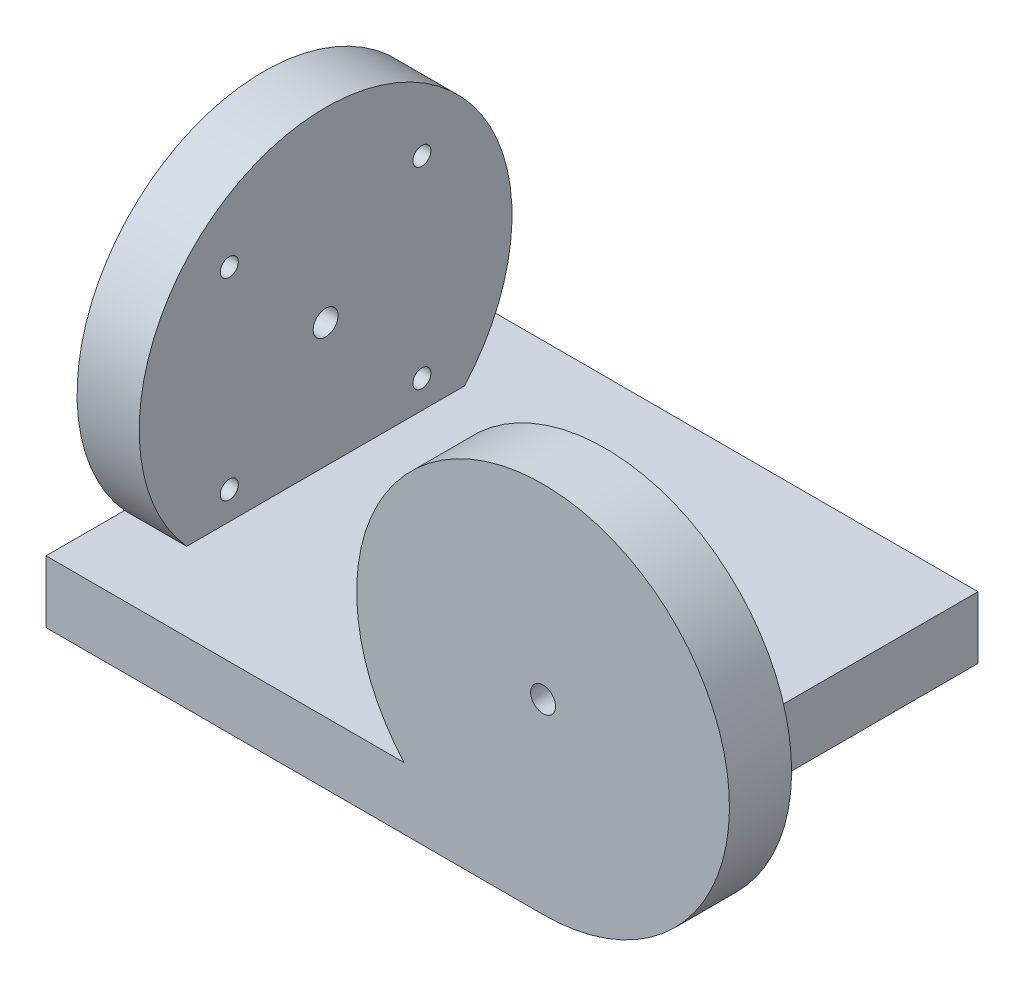
ISO-10303-21;
HEADER;
FILE_DESCRIPTION(('STEP AP214'),'2;1');
FILE_NAME('part.step','',(''),(''),'','','');
FILE_SCHEMA(('AUTOMOTIVE_DESIGN { 1 0 10303 214 1 1 1 1 }'));
ENDSEC;
DATA;
#1=APPLICATION_CONTEXT('core data for automotive mechanical design processes');
#2=APPLICATION_PROTOCOL_DEFINITION('international standard','automotive_design',2000,#1);
#3=PRODUCT_CONTEXT('',#1,'mechanical');
#4=PRODUCT('Part','Part','',(#3));
#5=PRODUCT_RELATED_PRODUCT_CATEGORY('part','',(#4));
#6=PRODUCT_DEFINITION_FORMATION('','',#4);
#7=PRODUCT_DEFINITION_CONTEXT('part definition',#1,'design');
#8=PRODUCT_DEFINITION('design','',#6,#7);
#9=PRODUCT_DEFINITION_SHAPE('','',#8);
#10=(LENGTH_UNIT() NAMED_UNIT(*) SI_UNIT(.MILLI.,.METRE.));
#11=(NAMED_UNIT(*) PLANE_ANGLE_UNIT() SI_UNIT($,.RADIAN.));
#12=(NAMED_UNIT(*) SI_UNIT($,.STERADIAN.) SOLID_ANGLE_UNIT());
#13=UNCERTAINTY_MEASURE_WITH_UNIT(LENGTH_MEASURE(1.E-05),#10,'distance_accuracy_value','');
#14=(GEOMETRIC_REPRESENTATION_CONTEXT(3) GLOBAL_UNCERTAINTY_ASSIGNED_CONTEXT((#13)) GLOBAL_UNIT_ASSIGNED_CONTEXT((#10,
#11,#12)) REPRESENTATION_CONTEXT('',''));
#15=CARTESIAN_POINT('',(0.,0.,0.));
#16=DIRECTION('',(0.,0.,1.));
#17=DIRECTION('',(1.,0.,0.));
#18=AXIS2_PLACEMENT_3D('',#15,#16,#17);
#19=CARTESIAN_POINT('',(0.,0.,0.));
#20=DIRECTION('',(0.,0.,1.));
#21=DIRECTION('',(1.,0.,0.));
#22=AXIS2_PLACEMENT_3D('',#19,#20,#21);
#23=PLANE('',#22);
#24=CARTESIAN_POINT('',(15.5,15.5,0.));
#25=DIRECTION('',(0.,0.,-1.));
#26=DIRECTION('',(-1.,0.,0.));
#27=AXIS2_PLACEMENT_3D('',#24,#25,#26);
#28=CIRCLE('',#27,1.45);
#29=CARTESIAN_POINT('',(14.05,15.5,0.));
#30=VERTEX_POINT('',#29);
#31=EDGE_CURVE('E166',#30,#30,#28,.T.);
#32=ORIENTED_EDGE('',*,*,#31,.F.);
#33=EDGE_LOOP('',(#32));
#34=FACE_BOUND('',#33,.T.);
#35=CARTESIAN_POINT('',(-15.5,15.5,0.));
#36=DIRECTION('',(0.,0.,-1.));
#37=DIRECTION('',(-1.,0.,0.));
#38=AXIS2_PLACEMENT_3D('',#35,#36,#37);
#39=CIRCLE('',#38,1.45);
#40=CARTESIAN_POINT('',(-16.95,15.5,0.));
#41=VERTEX_POINT('',#40);
#42=EDGE_CURVE('E172',#41,#41,#39,.T.);
#43=ORIENTED_EDGE('',*,*,#42,.F.);
#44=EDGE_LOOP('',(#43));
#45=FACE_BOUND('',#44,.T.);
#46=CARTESIAN_POINT('',(-15.5,-15.5,0.));
#47=DIRECTION('',(0.,0.,-1.));
#48=DIRECTION('',(-1.,0.,0.));
#49=AXIS2_PLACEMENT_3D('',#46,#47,#48);
#50=CIRCLE('',#49,1.45);
#51=CARTESIAN_POINT('',(-16.95,-15.5,0.));
#52=VERTEX_POINT('',#51);
#53=EDGE_CURVE('E178',#52,#52,#50,.T.);
#54=ORIENTED_EDGE('',*,*,#53,.F.);
#55=EDGE_LOOP('',(#54));
#56=FACE_BOUND('',#55,.T.);
#57=CARTESIAN_POINT('',(15.5,-15.5,0.));
#58=DIRECTION('',(0.,0.,-1.));
#59=DIRECTION('',(-1.,0.,0.));
#60=AXIS2_PLACEMENT_3D('',#57,#58,#59);
#61=CIRCLE('',#60,1.45);
#62=CARTESIAN_POINT('',(14.05,-15.5,0.));
#63=VERTEX_POINT('',#62);
#64=EDGE_CURVE('E184',#63,#63,#61,.T.);
#65=ORIENTED_EDGE('',*,*,#64,.F.);
#66=EDGE_LOOP('',(#65));
#67=FACE_BOUND('',#66,.T.);
#68=CARTESIAN_POINT('',(0.,0.,0.));
#69=DIRECTION('',(0.,0.,1.));
#70=DIRECTION('',(1.,0.,0.));
#71=AXIS2_PLACEMENT_3D('',#68,#69,#70);
#72=CIRCLE('',#71,30.);
#73=CARTESIAN_POINT('',(0.,-30.,0.));
#74=VERTEX_POINT('',#73);
#75=CARTESIAN_POINT('',(-22.3606797749979,-20.,0.));
#76=VERTEX_POINT('',#75);
#77=EDGE_CURVE('E242',#74,#76,#72,.T.);
#78=ORIENTED_EDGE('',*,*,#77,.F.);
#79=DIRECTION('',(0.,1.,0.));
#80=VECTOR('',#79,1.);
#81=CARTESIAN_POINT('',(0.,0.,0.));
#82=LINE('',#81,#80);
#83=CARTESIAN_POINT('',(0.,-20.,0.));
#84=VERTEX_POINT('',#83);
#85=EDGE_CURVE('E11',#74,#84,#82,.T.);
#86=ORIENTED_EDGE('',*,*,#85,.T.);
#87=DIRECTION('',(-1.,0.,0.));
#88=VECTOR('',#87,1.);
#89=CARTESIAN_POINT('',(0.,-20.,0.));
#90=LINE('',#89,#88);
#91=EDGE_CURVE('E52',#84,#76,#90,.T.);
#92=ORIENTED_EDGE('',*,*,#91,.T.);
#93=EDGE_LOOP('',(#78,#86,#92));
#94=FACE_BOUND('',#93,.T.);
#95=CARTESIAN_POINT('',(0.,0.,0.));
#96=DIRECTION('',(0.,0.,-1.));
#97=DIRECTION('',(-1.,0.,0.));
#98=AXIS2_PLACEMENT_3D('',#95,#96,#97);
#99=CIRCLE('',#98,2.);
#100=CARTESIAN_POINT('',(-2.,0.,0.));
#101=VERTEX_POINT('',#100);
#102=EDGE_CURVE('E190',#101,#101,#99,.T.);
#103=ORIENTED_EDGE('',*,*,#102,.F.);
#104=EDGE_LOOP('',(#103));
#105=FACE_BOUND('',#104,.T.);
#106=ADVANCED_FACE('F44',(#34,#45,#56,#67,#94,#105),#23,.F.);
#107=CARTESIAN_POINT('',(0.,0.,10.));
#108=DIRECTION('',(0.,0.,-1.));
#109=DIRECTION('',(-1.,0.,0.));
#110=AXIS2_PLACEMENT_3D('',#107,#108,#109);
#111=CYLINDRICAL_SURFACE('',#110,30.);
#112=CARTESIAN_POINT('',(0.,0.,10.));
#113=DIRECTION('',(0.,0.,1.));
#114=DIRECTION('',(1.,0.,0.));
#115=AXIS2_PLACEMENT_3D('',#112,#113,#114);
#116=CIRCLE('',#115,30.);
#117=CARTESIAN_POINT('',(0.,-30.,10.));
#118=VERTEX_POINT('',#117);
#119=CARTESIAN_POINT('',(-22.3606797749979,-20.,10.));
#120=VERTEX_POINT('',#119);
#121=EDGE_CURVE('E243',#118,#120,#116,.T.);
#122=ORIENTED_EDGE('',*,*,#121,.F.);
#123=DIRECTION('',(0.,0.,1.));
#124=VECTOR('',#123,1.);
#125=CARTESIAN_POINT('',(0.,-30.,-60.));
#126=LINE('',#125,#124);
#127=EDGE_CURVE('E232',#74,#118,#126,.T.);
#128=ORIENTED_EDGE('',*,*,#127,.F.);
#129=ORIENTED_EDGE('',*,*,#77,.T.);
#130=DIRECTION('',(0.,0.,-1.));
#131=VECTOR('',#130,1.);
#132=CARTESIAN_POINT('',(-22.3606797749979,-20.,10.));
#133=LINE('',#132,#131);
#134=EDGE_CURVE('E231',#76,#120,#133,.F.);
#135=ORIENTED_EDGE('',*,*,#134,.T.);
#136=EDGE_LOOP('',(#122,#128,#129,#135));
#137=FACE_BOUND('',#136,.T.);
#138=ADVANCED_FACE('F46',(#137),#111,.T.);
#139=CARTESIAN_POINT('',(0.,0.,10.));
#140=DIRECTION('',(0.,0.,1.));
#141=DIRECTION('',(1.,0.,0.));
#142=AXIS2_PLACEMENT_3D('',#139,#140,#141);
#143=PLANE('',#142);
#144=CARTESIAN_POINT('',(0.,0.,10.));
#145=DIRECTION('',(0.,0.,1.));
#146=DIRECTION('',(1.,0.,0.));
#147=AXIS2_PLACEMENT_3D('',#144,#145,#146);
#148=CIRCLE('',#147,2.);
#149=CARTESIAN_POINT('',(2.,0.,10.));
#150=VERTEX_POINT('',#149);
#151=EDGE_CURVE('E193',#150,#150,#148,.T.);
#152=ORIENTED_EDGE('',*,*,#151,.F.);
#153=EDGE_LOOP('',(#152));
#154=FACE_BOUND('',#153,.T.);
#155=ORIENTED_EDGE('',*,*,#121,.T.);
#156=DIRECTION('',(-1.,0.,0.));
#157=VECTOR('',#156,1.);
#158=CARTESIAN_POINT('',(0.,-20.,10.));
#159=LINE('',#158,#157);
#160=CARTESIAN_POINT('',(-80.,-20.,10.));
#161=VERTEX_POINT('',#160);
#162=EDGE_CURVE('E206',#120,#161,#159,.T.);
#163=ORIENTED_EDGE('',*,*,#162,.T.);
#164=DIRECTION('',(0.,-1.,0.));
#165=VECTOR('',#164,1.);
#166=CARTESIAN_POINT('',(-80.,-30.,10.));
#167=LINE('',#166,#165);
#168=CARTESIAN_POINT('',(-80.,-30.,10.));
#169=VERTEX_POINT('',#168);
#170=EDGE_CURVE('E223',#161,#169,#167,.T.);
#171=ORIENTED_EDGE('',*,*,#170,.T.);
#172=DIRECTION('',(1.,0.,0.));
#173=VECTOR('',#172,1.);
#174=CARTESIAN_POINT('',(0.,-30.,10.));
#175=LINE('',#174,#173);
#176=EDGE_CURVE('E211',#169,#118,#175,.T.);
#177=ORIENTED_EDGE('',*,*,#176,.T.);
#178=EDGE_LOOP('',(#155,#163,#171,#177));
#179=FACE_BOUND('',#178,.T.);
#180=ADVANCED_FACE('F258',(#154,#179),#143,.T.);
#181=CARTESIAN_POINT('',(0.,-30.,-60.));
#182=DIRECTION('',(1.,0.,0.));
#183=DIRECTION('',(0.,0.,-1.));
#184=AXIS2_PLACEMENT_3D('',#181,#182,#183);
#185=PLANE('',#184);
#186=ORIENTED_EDGE('',*,*,#85,.F.);
#187=CARTESIAN_POINT('',(0.,-30.,-60.));
#188=VERTEX_POINT('',#187);
#189=EDGE_CURVE('E228',#188,#74,#126,.T.);
#190=ORIENTED_EDGE('',*,*,#189,.F.);
#191=DIRECTION('',(0.,1.,0.));
#192=VECTOR('',#191,1.);
#193=CARTESIAN_POINT('',(0.,-30.,-60.));
#194=LINE('',#193,#192);
#195=CARTESIAN_POINT('',(0.,-20.,-60.));
#196=VERTEX_POINT('',#195);
#197=EDGE_CURVE('E207',#188,#196,#194,.T.);
#198=ORIENTED_EDGE('',*,*,#197,.T.);
#199=DIRECTION('',(0.,0.,1.));
#200=VECTOR('',#199,1.);
#201=CARTESIAN_POINT('',(0.,-20.,-60.));
#202=LINE('',#201,#200);
#203=EDGE_CURVE('E220',#196,#84,#202,.T.);
#204=ORIENTED_EDGE('',*,*,#203,.T.);
#205=EDGE_LOOP('',(#186,#190,#198,#204));
#206=FACE_BOUND('',#205,.T.);
#207=ADVANCED_FACE('F269',(#206),#185,.T.);
#208=CARTESIAN_POINT('',(0.,-20.,-60.));
#209=DIRECTION('',(0.,1.,0.));
#210=DIRECTION('',(-1.,0.,0.));
#211=AXIS2_PLACEMENT_3D('',#208,#209,#210);
#212=PLANE('',#211);
#213=DIRECTION('',(-1.,0.,0.));
#214=VECTOR('',#213,1.);
#215=CARTESIAN_POINT('',(-70.,-20.,-47.3606797749979));
#216=LINE('',#215,#214);
#217=CARTESIAN_POINT('',(-70.,-20.,-47.3606797749979));
#218=VERTEX_POINT('',#217);
#219=CARTESIAN_POINT('',(-80.,-20.,-47.3606797749979));
#220=VERTEX_POINT('',#219);
#221=EDGE_CURVE('E64',#218,#220,#216,.T.);
#222=ORIENTED_EDGE('',*,*,#221,.F.);
#223=DIRECTION('',(0.,0.,1.));
#224=VECTOR('',#223,1.);
#225=CARTESIAN_POINT('',(-70.,-20.,-60.));
#226=LINE('',#225,#224);
#227=CARTESIAN_POINT('',(-70.,-20.,-2.6393202250021));
#228=VERTEX_POINT('',#227);
#229=EDGE_CURVE('E59',#218,#228,#226,.T.);
#230=ORIENTED_EDGE('',*,*,#229,.T.);
#231=DIRECTION('',(-1.,0.,0.));
#232=VECTOR('',#231,1.);
#233=CARTESIAN_POINT('',(-70.,-20.,-2.6393202250021));
#234=LINE('',#233,#232);
#235=CARTESIAN_POINT('',(-80.,-20.,-2.6393202250021));
#236=VERTEX_POINT('',#235);
#237=EDGE_CURVE('E200',#236,#228,#234,.F.);
#238=ORIENTED_EDGE('',*,*,#237,.F.);
#239=DIRECTION('',(0.,0.,1.));
#240=VECTOR('',#239,1.);
#241=CARTESIAN_POINT('',(-80.,-20.,-60.));
#242=LINE('',#241,#240);
#243=EDGE_CURVE('E237',#236,#161,#242,.T.);
#244=ORIENTED_EDGE('',*,*,#243,.T.);
#245=ORIENTED_EDGE('',*,*,#162,.F.);
#246=ORIENTED_EDGE('',*,*,#134,.F.);
#247=ORIENTED_EDGE('',*,*,#91,.F.);
#248=ORIENTED_EDGE('',*,*,#203,.F.);
#249=DIRECTION('',(-1.,0.,0.));
#250=VECTOR('',#249,1.);
#251=CARTESIAN_POINT('',(0.,-20.,-60.));
#252=LINE('',#251,#250);
#253=CARTESIAN_POINT('',(-80.,-20.,-60.));
#254=VERTEX_POINT('',#253);
#255=EDGE_CURVE('E210',#196,#254,#252,.T.);
#256=ORIENTED_EDGE('',*,*,#255,.T.);
#257=EDGE_CURVE('E235',#254,#220,#242,.T.);
#258=ORIENTED_EDGE('',*,*,#257,.T.);
#259=EDGE_LOOP('',(#222,#230,#238,#244,#245,#246,#247,#248,#256,#258));
#260=FACE_BOUND('',#259,.T.);
#261=ADVANCED_FACE('F270',(#260),#212,.T.);
#262=CARTESIAN_POINT('',(0.,-30.,-60.));
#263=DIRECTION('',(0.,-1.,0.));
#264=DIRECTION('',(1.,0.,0.));
#265=AXIS2_PLACEMENT_3D('',#262,#263,#264);
#266=PLANE('',#265);
#267=ORIENTED_EDGE('',*,*,#176,.F.);
#268=DIRECTION('',(0.,0.,1.));
#269=VECTOR('',#268,1.);
#270=CARTESIAN_POINT('',(-80.,-30.,-60.));
#271=LINE('',#270,#269);
#272=CARTESIAN_POINT('',(-80.,-30.,-60.));
#273=VERTEX_POINT('',#272);
#274=EDGE_CURVE('E233',#273,#169,#271,.T.);
#275=ORIENTED_EDGE('',*,*,#274,.F.);
#276=DIRECTION('',(1.,0.,0.));
#277=VECTOR('',#276,1.);
#278=CARTESIAN_POINT('',(0.,-30.,-60.));
#279=LINE('',#278,#277);
#280=EDGE_CURVE('E217',#273,#188,#279,.T.);
#281=ORIENTED_EDGE('',*,*,#280,.T.);
#282=ORIENTED_EDGE('',*,*,#189,.T.);
#283=ORIENTED_EDGE('',*,*,#127,.T.);
#284=EDGE_LOOP('',(#267,#275,#281,#282,#283));
#285=FACE_BOUND('',#284,.T.);
#286=ADVANCED_FACE('F256',(#285),#266,.T.);
#287=CARTESIAN_POINT('',(-80.,-30.,-60.));
#288=DIRECTION('',(-1.,0.,0.));
#289=DIRECTION('',(0.,0.,1.));
#290=AXIS2_PLACEMENT_3D('',#287,#288,#289);
#291=PLANE('',#290);
#292=CARTESIAN_POINT('',(-80.,0.,-25.));
#293=DIRECTION('',(-1.,0.,0.));
#294=DIRECTION('',(0.,0.,1.));
#295=AXIS2_PLACEMENT_3D('',#292,#293,#294);
#296=CIRCLE('',#295,2.);
#297=CARTESIAN_POINT('',(-80.,0.,-23.));
#298=VERTEX_POINT('',#297);
#299=EDGE_CURVE('E163',#298,#298,#296,.T.);
#300=ORIENTED_EDGE('',*,*,#299,.F.);
#301=EDGE_LOOP('',(#300));
#302=FACE_BOUND('',#301,.T.);
#303=ORIENTED_EDGE('',*,*,#243,.F.);
#304=CARTESIAN_POINT('',(-80.,0.,-25.));
#305=DIRECTION('',(-1.,0.,0.));
#306=DIRECTION('',(0.,0.,1.));
#307=AXIS2_PLACEMENT_3D('',#304,#305,#306);
#308=CIRCLE('',#307,30.);
#309=EDGE_CURVE('E196',#236,#220,#308,.T.);
#310=ORIENTED_EDGE('',*,*,#309,.T.);
#311=ORIENTED_EDGE('',*,*,#257,.F.);
#312=DIRECTION('',(0.,-1.,0.));
#313=VECTOR('',#312,1.);
#314=CARTESIAN_POINT('',(-80.,-30.,-60.));
#315=LINE('',#314,#313);
#316=EDGE_CURVE('E214',#254,#273,#315,.T.);
#317=ORIENTED_EDGE('',*,*,#316,.T.);
#318=ORIENTED_EDGE('',*,*,#274,.T.);
#319=ORIENTED_EDGE('',*,*,#170,.F.);
#320=EDGE_LOOP('',(#303,#310,#311,#317,#318,#319));
#321=FACE_BOUND('',#320,.T.);
#322=ADVANCED_FACE('F261',(#302,#321),#291,.T.);
#323=CARTESIAN_POINT('',(0.,0.,-60.));
#324=DIRECTION('',(0.,0.,1.));
#325=DIRECTION('',(1.,0.,0.));
#326=AXIS2_PLACEMENT_3D('',#323,#324,#325);
#327=PLANE('',#326);
#328=ORIENTED_EDGE('',*,*,#197,.F.);
#329=ORIENTED_EDGE('',*,*,#280,.F.);
#330=ORIENTED_EDGE('',*,*,#316,.F.);
#331=ORIENTED_EDGE('',*,*,#255,.F.);
#332=EDGE_LOOP('',(#328,#329,#330,#331));
#333=FACE_BOUND('',#332,.T.);
#334=ADVANCED_FACE('F266',(#333),#327,.F.);
#335=CARTESIAN_POINT('',(-70.,0.,-25.));
#336=DIRECTION('',(-1.,0.,0.));
#337=DIRECTION('',(0.,0.,1.));
#338=AXIS2_PLACEMENT_3D('',#335,#336,#337);
#339=CYLINDRICAL_SURFACE('',#338,30.);
#340=CARTESIAN_POINT('',(-70.,0.,-25.));
#341=DIRECTION('',(-1.,0.,0.));
#342=DIRECTION('',(0.,0.,1.));
#343=AXIS2_PLACEMENT_3D('',#340,#341,#342);
#344=CIRCLE('',#343,30.);
#345=EDGE_CURVE('E197',#228,#218,#344,.T.);
#346=ORIENTED_EDGE('',*,*,#345,.T.);
#347=ORIENTED_EDGE('',*,*,#221,.T.);
#348=ORIENTED_EDGE('',*,*,#309,.F.);
#349=ORIENTED_EDGE('',*,*,#237,.T.);
#350=EDGE_LOOP('',(#346,#347,#348,#349));
#351=FACE_BOUND('',#350,.T.);
#352=ADVANCED_FACE('F273',(#351),#339,.T.);
#353=CARTESIAN_POINT('',(-70.,0.,-25.));
#354=DIRECTION('',(-1.,0.,0.));
#355=DIRECTION('',(0.,0.,1.));
#356=AXIS2_PLACEMENT_3D('',#353,#354,#355);
#357=PLANE('',#356);
#358=CARTESIAN_POINT('',(-70.,15.5,-9.49999999999999));
#359=DIRECTION('',(1.,0.,0.));
#360=DIRECTION('',(0.,0.,-1.));
#361=AXIS2_PLACEMENT_3D('',#358,#359,#360);
#362=CIRCLE('',#361,1.45);
#363=CARTESIAN_POINT('',(-70.,15.5,-10.95));
#364=VERTEX_POINT('',#363);
#365=EDGE_CURVE('E138',#364,#364,#362,.T.);
#366=ORIENTED_EDGE('',*,*,#365,.F.);
#367=EDGE_LOOP('',(#366));
#368=FACE_BOUND('',#367,.T.);
#369=CARTESIAN_POINT('',(-70.,15.5,-40.5));
#370=DIRECTION('',(1.,0.,0.));
#371=DIRECTION('',(0.,0.,-1.));
#372=AXIS2_PLACEMENT_3D('',#369,#370,#371);
#373=CIRCLE('',#372,1.45);
#374=CARTESIAN_POINT('',(-70.,15.5,-41.95));
#375=VERTEX_POINT('',#374);
#376=EDGE_CURVE('E137',#375,#375,#373,.T.);
#377=ORIENTED_EDGE('',*,*,#376,.F.);
#378=EDGE_LOOP('',(#377));
#379=FACE_BOUND('',#378,.T.);
#380=CARTESIAN_POINT('',(-70.,-15.5,-40.5));
#381=DIRECTION('',(1.,0.,0.));
#382=DIRECTION('',(0.,0.,-1.));
#383=AXIS2_PLACEMENT_3D('',#380,#381,#382);
#384=CIRCLE('',#383,1.45);
#385=CARTESIAN_POINT('',(-70.,-15.5,-41.95));
#386=VERTEX_POINT('',#385);
#387=EDGE_CURVE('E148',#386,#386,#384,.T.);
#388=ORIENTED_EDGE('',*,*,#387,.F.);
#389=EDGE_LOOP('',(#388));
#390=FACE_BOUND('',#389,.T.);
#391=CARTESIAN_POINT('',(-70.,-15.5,-9.49999999999999));
#392=DIRECTION('',(1.,0.,0.));
#393=DIRECTION('',(0.,0.,-1.));
#394=AXIS2_PLACEMENT_3D('',#391,#392,#393);
#395=CIRCLE('',#394,1.45);
#396=CARTESIAN_POINT('',(-70.,-15.5,-10.95));
#397=VERTEX_POINT('',#396);
#398=EDGE_CURVE('E154',#397,#397,#395,.T.);
#399=ORIENTED_EDGE('',*,*,#398,.F.);
#400=EDGE_LOOP('',(#399));
#401=FACE_BOUND('',#400,.T.);
#402=CARTESIAN_POINT('',(-70.,0.,-25.));
#403=DIRECTION('',(1.,0.,0.));
#404=DIRECTION('',(0.,0.,-1.));
#405=AXIS2_PLACEMENT_3D('',#402,#403,#404);
#406=CIRCLE('',#405,2.);
#407=CARTESIAN_POINT('',(-70.,0.,-27.));
#408=VERTEX_POINT('',#407);
#409=EDGE_CURVE('E160',#408,#408,#406,.T.);
#410=ORIENTED_EDGE('',*,*,#409,.F.);
#411=EDGE_LOOP('',(#410));
#412=FACE_BOUND('',#411,.T.);
#413=ORIENTED_EDGE('',*,*,#229,.F.);
#414=ORIENTED_EDGE('',*,*,#345,.F.);
#415=EDGE_LOOP('',(#413,#414));
#416=FACE_BOUND('',#415,.T.);
#417=ADVANCED_FACE('F276',(#368,#379,#390,#401,#412,#416),#357,.F.);
#418=CARTESIAN_POINT('',(0.,0.,0.));
#419=DIRECTION('',(0.,0.,-1.));
#420=DIRECTION('',(-1.,0.,0.));
#421=AXIS2_PLACEMENT_3D('',#418,#419,#420);
#422=CYLINDRICAL_SURFACE('',#421,2.);
#423=ORIENTED_EDGE('',*,*,#151,.T.);
#424=EDGE_LOOP('',(#423));
#425=FACE_BOUND('',#424,.T.);
#426=ORIENTED_EDGE('',*,*,#102,.T.);
#427=EDGE_LOOP('',(#426));
#428=FACE_BOUND('',#427,.T.);
#429=ADVANCED_FACE('F278',(#425,#428),#422,.F.);
#430=CARTESIAN_POINT('',(15.5,-15.5,8.8));
#431=DIRECTION('',(0.,0.,-1.));
#432=DIRECTION('',(-1.,0.,0.));
#433=AXIS2_PLACEMENT_3D('',#430,#431,#432);
#434=CONICAL_SURFACE('',#433,1.45,1.02974425867665);
#435=CARTESIAN_POINT('',(15.5,-15.5,9.67124789758996));
#436=VERTEX_POINT('',#435);
#437=VERTEX_LOOP('',#436);
#438=FACE_BOUND('',#437,.T.);
#439=CARTESIAN_POINT('',(15.5,-15.5,8.8));
#440=DIRECTION('',(0.,0.,-1.));
#441=DIRECTION('',(-1.,0.,0.));
#442=AXIS2_PLACEMENT_3D('',#439,#440,#441);
#443=CIRCLE('',#442,1.45);
#444=CARTESIAN_POINT('',(14.05,-15.5,8.8));
#445=VERTEX_POINT('',#444);
#446=EDGE_CURVE('E187',#445,#445,#443,.T.);
#447=ORIENTED_EDGE('',*,*,#446,.T.);
#448=EDGE_LOOP('',(#447));
#449=FACE_BOUND('',#448,.T.);
#450=ADVANCED_FACE('F285',(#438,#449),#434,.F.);
#451=CARTESIAN_POINT('',(15.5,-15.5,0.));
#452=DIRECTION('',(0.,0.,-1.));
#453=DIRECTION('',(-1.,0.,0.));
#454=AXIS2_PLACEMENT_3D('',#451,#452,#453);
#455=CYLINDRICAL_SURFACE('',#454,1.45);
#456=ORIENTED_EDGE('',*,*,#446,.F.);
#457=EDGE_LOOP('',(#456));
#458=FACE_BOUND('',#457,.T.);
#459=ORIENTED_EDGE('',*,*,#64,.T.);
#460=EDGE_LOOP('',(#459));
#461=FACE_BOUND('',#460,.T.);
#462=ADVANCED_FACE('F361',(#458,#461),#455,.F.);
#463=CARTESIAN_POINT('',(-15.5,-15.5,8.8));
#464=DIRECTION('',(0.,0.,-1.));
#465=DIRECTION('',(-1.,0.,0.));
#466=AXIS2_PLACEMENT_3D('',#463,#464,#465);
#467=CONICAL_SURFACE('',#466,1.45,1.02974425867665);
#468=CARTESIAN_POINT('',(-15.5,-15.5,9.67124789758996));
#469=VERTEX_POINT('',#468);
#470=VERTEX_LOOP('',#469);
#471=FACE_BOUND('',#470,.T.);
#472=CARTESIAN_POINT('',(-15.5,-15.5,8.8));
#473=DIRECTION('',(0.,0.,-1.));
#474=DIRECTION('',(-1.,0.,0.));
#475=AXIS2_PLACEMENT_3D('',#472,#473,#474);
#476=CIRCLE('',#475,1.45);
#477=CARTESIAN_POINT('',(-16.95,-15.5,8.8));
#478=VERTEX_POINT('',#477);
#479=EDGE_CURVE('E181',#478,#478,#476,.T.);
#480=ORIENTED_EDGE('',*,*,#479,.T.);
#481=EDGE_LOOP('',(#480));
#482=FACE_BOUND('',#481,.T.);
#483=ADVANCED_FACE('F372',(#471,#482),#467,.F.);
#484=CARTESIAN_POINT('',(-15.5,-15.5,0.));
#485=DIRECTION('',(0.,0.,-1.));
#486=DIRECTION('',(-1.,0.,0.));
#487=AXIS2_PLACEMENT_3D('',#484,#485,#486);
#488=CYLINDRICAL_SURFACE('',#487,1.45);
#489=ORIENTED_EDGE('',*,*,#479,.F.);
#490=EDGE_LOOP('',(#489));
#491=FACE_BOUND('',#490,.T.);
#492=ORIENTED_EDGE('',*,*,#53,.T.);
#493=EDGE_LOOP('',(#492));
#494=FACE_BOUND('',#493,.T.);
#495=ADVANCED_FACE('F383',(#491,#494),#488,.F.);
#496=CARTESIAN_POINT('',(-15.5,15.5,8.8));
#497=DIRECTION('',(0.,0.,-1.));
#498=DIRECTION('',(-1.,0.,0.));
#499=AXIS2_PLACEMENT_3D('',#496,#497,#498);
#500=CONICAL_SURFACE('',#499,1.45,1.02974425867665);
#501=CARTESIAN_POINT('',(-15.5,15.5,9.67124789758996));
#502=VERTEX_POINT('',#501);
#503=VERTEX_LOOP('',#502);
#504=FACE_BOUND('',#503,.T.);
#505=CARTESIAN_POINT('',(-15.5,15.5,8.8));
#506=DIRECTION('',(0.,0.,-1.));
#507=DIRECTION('',(-1.,0.,0.));
#508=AXIS2_PLACEMENT_3D('',#505,#506,#507);
#509=CIRCLE('',#508,1.45);
#510=CARTESIAN_POINT('',(-16.95,15.5,8.8));
#511=VERTEX_POINT('',#510);
#512=EDGE_CURVE('E175',#511,#511,#509,.T.);
#513=ORIENTED_EDGE('',*,*,#512,.T.);
#514=EDGE_LOOP('',(#513));
#515=FACE_BOUND('',#514,.T.);
#516=ADVANCED_FACE('F393',(#504,#515),#500,.F.);
#517=CARTESIAN_POINT('',(-15.5,15.5,0.));
#518=DIRECTION('',(0.,0.,-1.));
#519=DIRECTION('',(-1.,0.,0.));
#520=AXIS2_PLACEMENT_3D('',#517,#518,#519);
#521=CYLINDRICAL_SURFACE('',#520,1.45);
#522=ORIENTED_EDGE('',*,*,#512,.F.);
#523=EDGE_LOOP('',(#522));
#524=FACE_BOUND('',#523,.T.);
#525=ORIENTED_EDGE('',*,*,#42,.T.);
#526=EDGE_LOOP('',(#525));
#527=FACE_BOUND('',#526,.T.);
#528=ADVANCED_FACE('F404',(#524,#527),#521,.F.);
#529=CARTESIAN_POINT('',(15.5,15.5,8.8));
#530=DIRECTION('',(0.,0.,-1.));
#531=DIRECTION('',(-1.,0.,0.));
#532=AXIS2_PLACEMENT_3D('',#529,#530,#531);
#533=CONICAL_SURFACE('',#532,1.45,1.02974425867665);
#534=CARTESIAN_POINT('',(15.5,15.5,9.67124789758996));
#535=VERTEX_POINT('',#534);
#536=VERTEX_LOOP('',#535);
#537=FACE_BOUND('',#536,.T.);
#538=CARTESIAN_POINT('',(15.5,15.5,8.8));
#539=DIRECTION('',(0.,0.,-1.));
#540=DIRECTION('',(-1.,0.,0.));
#541=AXIS2_PLACEMENT_3D('',#538,#539,#540);
#542=CIRCLE('',#541,1.45);
#543=CARTESIAN_POINT('',(14.05,15.5,8.8));
#544=VERTEX_POINT('',#543);
#545=EDGE_CURVE('E169',#544,#544,#542,.T.);
#546=ORIENTED_EDGE('',*,*,#545,.T.);
#547=EDGE_LOOP('',(#546));
#548=FACE_BOUND('',#547,.T.);
#549=ADVANCED_FACE('F414',(#537,#548),#533,.F.);
#550=CARTESIAN_POINT('',(15.5,15.5,0.));
#551=DIRECTION('',(0.,0.,-1.));
#552=DIRECTION('',(-1.,0.,0.));
#553=AXIS2_PLACEMENT_3D('',#550,#551,#552);
#554=CYLINDRICAL_SURFACE('',#553,1.45);
#555=ORIENTED_EDGE('',*,*,#545,.F.);
#556=EDGE_LOOP('',(#555));
#557=FACE_BOUND('',#556,.T.);
#558=ORIENTED_EDGE('',*,*,#31,.T.);
#559=EDGE_LOOP('',(#558));
#560=FACE_BOUND('',#559,.T.);
#561=ADVANCED_FACE('F426',(#557,#560),#554,.F.);
#562=CARTESIAN_POINT('',(-70.,0.,-25.));
#563=DIRECTION('',(1.,0.,0.));
#564=DIRECTION('',(0.,0.,-1.));
#565=AXIS2_PLACEMENT_3D('',#562,#563,#564);
#566=CYLINDRICAL_SURFACE('',#565,2.);
#567=ORIENTED_EDGE('',*,*,#299,.T.);
#568=EDGE_LOOP('',(#567));
#569=FACE_BOUND('',#568,.T.);
#570=ORIENTED_EDGE('',*,*,#409,.T.);
#571=EDGE_LOOP('',(#570));
#572=FACE_BOUND('',#571,.T.);
#573=ADVANCED_FACE('F435',(#569,#572),#566,.F.);
#574=CARTESIAN_POINT('',(-78.8,-15.5,-9.49999999999999));
#575=DIRECTION('',(1.,0.,0.));
#576=DIRECTION('',(0.,0.,-1.));
#577=AXIS2_PLACEMENT_3D('',#574,#575,#576);
#578=CONICAL_SURFACE('',#577,1.45,1.02974425867665);
#579=CARTESIAN_POINT('',(-79.67124789759,-15.5,-9.49999999999999));
#580=VERTEX_POINT('',#579);
#581=VERTEX_LOOP('',#580);
#582=FACE_BOUND('',#581,.T.);
#583=CARTESIAN_POINT('',(-78.8,-15.5,-9.49999999999999));
#584=DIRECTION('',(1.,0.,0.));
#585=DIRECTION('',(0.,0.,-1.));
#586=AXIS2_PLACEMENT_3D('',#583,#584,#585);
#587=CIRCLE('',#586,1.45);
#588=CARTESIAN_POINT('',(-78.8,-15.5,-10.95));
#589=VERTEX_POINT('',#588);
#590=EDGE_CURVE('E157',#589,#589,#587,.T.);
#591=ORIENTED_EDGE('',*,*,#590,.T.);
#592=EDGE_LOOP('',(#591));
#593=FACE_BOUND('',#592,.T.);
#594=ADVANCED_FACE('F452',(#582,#593),#578,.F.);
#595=CARTESIAN_POINT('',(-70.,-15.5,-9.49999999999999));
#596=DIRECTION('',(1.,0.,0.));
#597=DIRECTION('',(0.,0.,-1.));
#598=AXIS2_PLACEMENT_3D('',#595,#596,#597);
#599=CYLINDRICAL_SURFACE('',#598,1.45);
#600=ORIENTED_EDGE('',*,*,#590,.F.);
#601=EDGE_LOOP('',(#600));
#602=FACE_BOUND('',#601,.T.);
#603=ORIENTED_EDGE('',*,*,#398,.T.);
#604=EDGE_LOOP('',(#603));
#605=FACE_BOUND('',#604,.T.);
#606=ADVANCED_FACE('F472',(#602,#605),#599,.F.);
#607=CARTESIAN_POINT('',(-78.8,-15.5,-40.5));
#608=DIRECTION('',(1.,0.,0.));
#609=DIRECTION('',(0.,0.,-1.));
#610=AXIS2_PLACEMENT_3D('',#607,#608,#609);
#611=CONICAL_SURFACE('',#610,1.45,1.02974425867665);
#612=CARTESIAN_POINT('',(-79.67124789759,-15.5,-40.5));
#613=VERTEX_POINT('',#612);
#614=VERTEX_LOOP('',#613);
#615=FACE_BOUND('',#614,.T.);
#616=CARTESIAN_POINT('',(-78.8,-15.5,-40.5));
#617=DIRECTION('',(1.,0.,0.));
#618=DIRECTION('',(0.,0.,-1.));
#619=AXIS2_PLACEMENT_3D('',#616,#617,#618);
#620=CIRCLE('',#619,1.45);
#621=CARTESIAN_POINT('',(-78.8,-15.5,-41.95));
#622=VERTEX_POINT('',#621);
#623=EDGE_CURVE('E151',#622,#622,#620,.T.);
#624=ORIENTED_EDGE('',*,*,#623,.T.);
#625=EDGE_LOOP('',(#624));
#626=FACE_BOUND('',#625,.T.);
#627=ADVANCED_FACE('F482',(#615,#626),#611,.F.);
#628=CARTESIAN_POINT('',(-70.,-15.5,-40.5));
#629=DIRECTION('',(1.,0.,0.));
#630=DIRECTION('',(0.,0.,-1.));
#631=AXIS2_PLACEMENT_3D('',#628,#629,#630);
#632=CYLINDRICAL_SURFACE('',#631,1.45);
#633=ORIENTED_EDGE('',*,*,#623,.F.);
#634=EDGE_LOOP('',(#633));
#635=FACE_BOUND('',#634,.T.);
#636=ORIENTED_EDGE('',*,*,#387,.T.);
#637=EDGE_LOOP('',(#636));
#638=FACE_BOUND('',#637,.T.);
#639=ADVANCED_FACE('F494',(#635,#638),#632,.F.);
#640=CARTESIAN_POINT('',(-78.8,15.5,-40.5));
#641=DIRECTION('',(1.,0.,0.));
#642=DIRECTION('',(0.,0.,-1.));
#643=AXIS2_PLACEMENT_3D('',#640,#641,#642);
#644=CONICAL_SURFACE('',#643,1.45,1.02974425867665);
#645=CARTESIAN_POINT('',(-79.67124789759,15.5,-40.5));
#646=VERTEX_POINT('',#645);
#647=VERTEX_LOOP('',#646);
#648=FACE_BOUND('',#647,.T.);
#649=CARTESIAN_POINT('',(-78.8,15.5,-40.5));
#650=DIRECTION('',(1.,0.,0.));
#651=DIRECTION('',(0.,0.,-1.));
#652=AXIS2_PLACEMENT_3D('',#649,#650,#651);
#653=CIRCLE('',#652,1.45);
#654=CARTESIAN_POINT('',(-78.8,15.5,-41.95));
#655=VERTEX_POINT('',#654);
#656=EDGE_CURVE('E141',#655,#655,#653,.T.);
#657=ORIENTED_EDGE('',*,*,#656,.T.);
#658=EDGE_LOOP('',(#657));
#659=FACE_BOUND('',#658,.T.);
#660=ADVANCED_FACE('F504',(#648,#659),#644,.F.);
#661=CARTESIAN_POINT('',(-70.,15.5,-40.5));
#662=DIRECTION('',(1.,0.,0.));
#663=DIRECTION('',(0.,0.,-1.));
#664=AXIS2_PLACEMENT_3D('',#661,#662,#663);
#665=CYLINDRICAL_SURFACE('',#664,1.45);
#666=ORIENTED_EDGE('',*,*,#656,.F.);
#667=EDGE_LOOP('',(#666));
#668=FACE_BOUND('',#667,.T.);
#669=ORIENTED_EDGE('',*,*,#376,.T.);
#670=EDGE_LOOP('',(#669));
#671=FACE_BOUND('',#670,.T.);
#672=ADVANCED_FACE('F131',(#668,#671),#665,.F.);
#673=CARTESIAN_POINT('',(-78.8,15.5,-9.49999999999999));
#674=DIRECTION('',(1.,0.,0.));
#675=DIRECTION('',(0.,0.,-1.));
#676=AXIS2_PLACEMENT_3D('',#673,#674,#675);
#677=CONICAL_SURFACE('',#676,1.45,1.02974425867665);
#678=CARTESIAN_POINT('',(-79.67124789759,15.5,-9.49999999999999));
#679=VERTEX_POINT('',#678);
#680=VERTEX_LOOP('',#679);
#681=FACE_BOUND('',#680,.T.);
#682=CARTESIAN_POINT('',(-78.8,15.5,-9.49999999999999));
#683=DIRECTION('',(1.,0.,0.));
#684=DIRECTION('',(0.,0.,-1.));
#685=AXIS2_PLACEMENT_3D('',#682,#683,#684);
#686=CIRCLE('',#685,1.45);
#687=CARTESIAN_POINT('',(-78.8,15.5,-10.95));
#688=VERTEX_POINT('',#687);
#689=EDGE_CURVE('E135',#688,#688,#686,.T.);
#690=ORIENTED_EDGE('',*,*,#689,.T.);
#691=EDGE_LOOP('',(#690));
#692=FACE_BOUND('',#691,.T.);
#693=ADVANCED_FACE('F127',(#681,#692),#677,.F.);
#694=CARTESIAN_POINT('',(-70.,15.5,-9.49999999999999));
#695=DIRECTION('',(1.,0.,0.));
#696=DIRECTION('',(0.,0.,-1.));
#697=AXIS2_PLACEMENT_3D('',#694,#695,#696);
#698=CYLINDRICAL_SURFACE('',#697,1.45);
#699=ORIENTED_EDGE('',*,*,#689,.F.);
#700=EDGE_LOOP('',(#699));
#701=FACE_BOUND('',#700,.T.);
#702=ORIENTED_EDGE('',*,*,#365,.T.);
#703=EDGE_LOOP('',(#702));
#704=FACE_BOUND('',#703,.T.);
#705=ADVANCED_FACE('F130',(#701,#704),#698,.F.);
#706=CLOSED_SHELL('',(#106,#138,#180,#207,#261,#286,#322,#334,#352,#417,#429,#450,#462,#483,
#495,#516,#528,#549,#561,#573,#594,#606,#627,#639,#660,#672,#693,#705));
#707=MANIFOLD_SOLID_BREP('B2',#706);
#708=ADVANCED_BREP_SHAPE_REPRESENTATION('',(#18,#707),#14);
#709=SHAPE_DEFINITION_REPRESENTATION(#9,#708);
ENDSEC;
END-ISO-10303-21;
